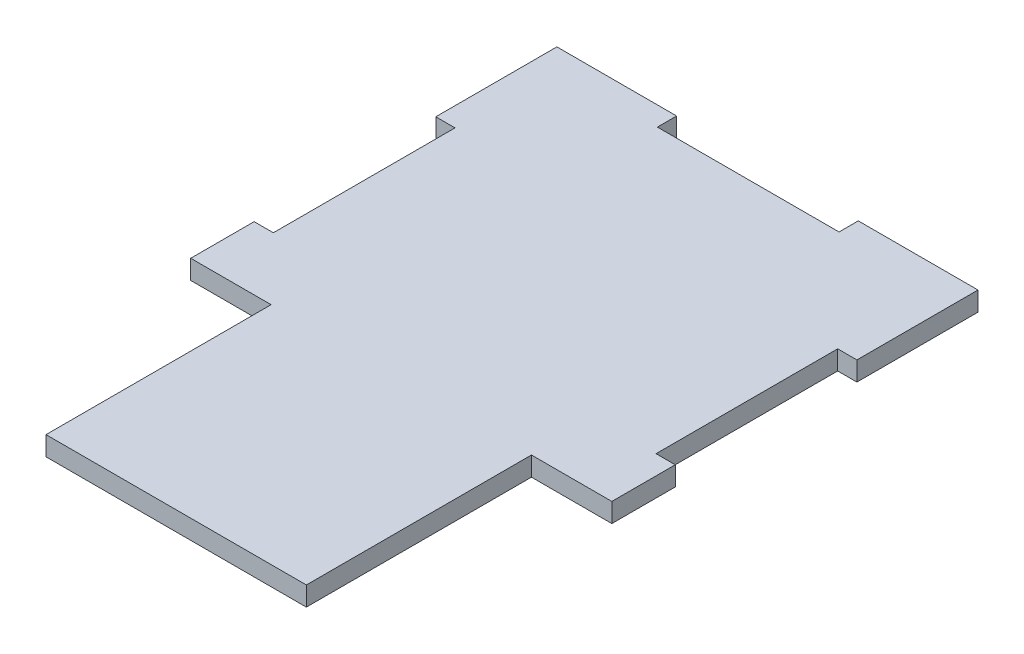
ISO-10303-21;
HEADER;
FILE_DESCRIPTION(('STEP AP214'),'2;1');
FILE_NAME('part.step','',(''),(''),'','','');
FILE_SCHEMA(('AUTOMOTIVE_DESIGN { 1 0 10303 214 1 1 1 1 }'));
ENDSEC;
DATA;
#1=APPLICATION_CONTEXT('core data for automotive mechanical design processes');
#2=APPLICATION_PROTOCOL_DEFINITION('international standard','automotive_design',2000,#1);
#3=PRODUCT_CONTEXT('',#1,'mechanical');
#4=PRODUCT('Part','Part','',(#3));
#5=PRODUCT_RELATED_PRODUCT_CATEGORY('part','',(#4));
#6=PRODUCT_DEFINITION_FORMATION('','',#4);
#7=PRODUCT_DEFINITION_CONTEXT('part definition',#1,'design');
#8=PRODUCT_DEFINITION('design','',#6,#7);
#9=PRODUCT_DEFINITION_SHAPE('','',#8);
#10=(LENGTH_UNIT() NAMED_UNIT(*) SI_UNIT(.MILLI.,.METRE.));
#11=(NAMED_UNIT(*) PLANE_ANGLE_UNIT() SI_UNIT($,.RADIAN.));
#12=(NAMED_UNIT(*) SI_UNIT($,.STERADIAN.) SOLID_ANGLE_UNIT());
#13=UNCERTAINTY_MEASURE_WITH_UNIT(LENGTH_MEASURE(1.E-05),#10,'distance_accuracy_value','');
#14=(GEOMETRIC_REPRESENTATION_CONTEXT(3) GLOBAL_UNCERTAINTY_ASSIGNED_CONTEXT((#13)) GLOBAL_UNIT_ASSIGNED_CONTEXT((#10,
#11,#12)) REPRESENTATION_CONTEXT('',''));
#15=CARTESIAN_POINT('',(0.,0.,0.));
#16=DIRECTION('',(0.,0.,1.));
#17=DIRECTION('',(1.,0.,0.));
#18=AXIS2_PLACEMENT_3D('',#15,#16,#17);
#19=CARTESIAN_POINT('',(66.375,3.175,0.));
#20=DIRECTION('',(-1.,0.,0.));
#21=DIRECTION('',(0.,0.,1.));
#22=AXIS2_PLACEMENT_3D('',#19,#20,#21);
#23=PLANE('',#22);
#24=DIRECTION('',(0.,0.,-1.));
#25=VECTOR('',#24,1.);
#26=CARTESIAN_POINT('',(66.375,0.,0.));
#27=LINE('',#26,#25);
#28=CARTESIAN_POINT('',(66.375,0.,-44.475));
#29=VERTEX_POINT('',#28);
#30=CARTESIAN_POINT('',(66.375,0.,-74.475));
#31=VERTEX_POINT('',#30);
#32=EDGE_CURVE('E218',#29,#31,#27,.T.);
#33=ORIENTED_EDGE('',*,*,#32,.T.);
#34=DIRECTION('',(0.,-1.,0.));
#35=VECTOR('',#34,1.);
#36=CARTESIAN_POINT('',(66.375,3.175,-74.475));
#37=LINE('',#36,#35);
#38=CARTESIAN_POINT('',(66.375,3.175,-74.475));
#39=VERTEX_POINT('',#38);
#40=EDGE_CURVE('E11',#39,#31,#37,.T.);
#41=ORIENTED_EDGE('',*,*,#40,.F.);
#42=DIRECTION('',(0.,0.,-1.));
#43=VECTOR('',#42,1.);
#44=CARTESIAN_POINT('',(66.375,3.175,0.));
#45=LINE('',#44,#43);
#46=CARTESIAN_POINT('',(66.375,3.175,-44.475));
#47=VERTEX_POINT('',#46);
#48=EDGE_CURVE('E283',#47,#39,#45,.T.);
#49=ORIENTED_EDGE('',*,*,#48,.F.);
#50=DIRECTION('',(0.,-1.,0.));
#51=VECTOR('',#50,1.);
#52=CARTESIAN_POINT('',(66.375,3.175,-44.475));
#53=LINE('',#52,#51);
#54=EDGE_CURVE('E58',#47,#29,#53,.T.);
#55=ORIENTED_EDGE('',*,*,#54,.T.);
#56=EDGE_LOOP('',(#33,#41,#49,#55));
#57=FACE_BOUND('',#56,.T.);
#58=ADVANCED_FACE('F41',(#57),#23,.F.);
#59=CARTESIAN_POINT('',(0.,3.175,-74.475));
#60=DIRECTION('',(0.,0.,-1.));
#61=DIRECTION('',(-1.,0.,0.));
#62=AXIS2_PLACEMENT_3D('',#59,#60,#61);
#63=PLANE('',#62);
#64=DIRECTION('',(1.,0.,0.));
#65=VECTOR('',#64,1.);
#66=CARTESIAN_POINT('',(0.,0.,-74.475));
#67=LINE('',#66,#65);
#68=CARTESIAN_POINT('',(69.55,0.,-74.475));
#69=VERTEX_POINT('',#68);
#70=EDGE_CURVE('E221',#31,#69,#67,.T.);
#71=ORIENTED_EDGE('',*,*,#70,.T.);
#72=DIRECTION('',(0.,-1.,0.));
#73=VECTOR('',#72,1.);
#74=CARTESIAN_POINT('',(69.55,3.175,-74.475));
#75=LINE('',#74,#73);
#76=CARTESIAN_POINT('',(69.55,3.175,-74.475));
#77=VERTEX_POINT('',#76);
#78=EDGE_CURVE('E50',#77,#69,#75,.T.);
#79=ORIENTED_EDGE('',*,*,#78,.F.);
#80=DIRECTION('',(1.,0.,0.));
#81=VECTOR('',#80,1.);
#82=CARTESIAN_POINT('',(0.,3.175,-74.475));
#83=LINE('',#82,#81);
#84=EDGE_CURVE('E133',#39,#77,#83,.T.);
#85=ORIENTED_EDGE('',*,*,#84,.F.);
#86=ORIENTED_EDGE('',*,*,#40,.T.);
#87=EDGE_LOOP('',(#71,#79,#85,#86));
#88=FACE_BOUND('',#87,.T.);
#89=ADVANCED_FACE('F430',(#88),#63,.F.);
#90=CARTESIAN_POINT('',(69.55,3.175,0.));
#91=DIRECTION('',(-1.,0.,0.));
#92=DIRECTION('',(0.,0.,1.));
#93=AXIS2_PLACEMENT_3D('',#90,#91,#92);
#94=PLANE('',#93);
#95=DIRECTION('',(0.,0.,-1.));
#96=VECTOR('',#95,1.);
#97=CARTESIAN_POINT('',(69.55,0.,0.));
#98=LINE('',#97,#96);
#99=CARTESIAN_POINT('',(69.55,0.,-94.475));
#100=VERTEX_POINT('',#99);
#101=EDGE_CURVE('E224',#69,#100,#98,.T.);
#102=ORIENTED_EDGE('',*,*,#101,.T.);
#103=DIRECTION('',(0.,-1.,0.));
#104=VECTOR('',#103,1.);
#105=CARTESIAN_POINT('',(69.55,3.175,-94.475));
#106=LINE('',#105,#104);
#107=CARTESIAN_POINT('',(69.55,3.175,-94.475));
#108=VERTEX_POINT('',#107);
#109=EDGE_CURVE('E331',#108,#100,#106,.T.);
#110=ORIENTED_EDGE('',*,*,#109,.F.);
#111=DIRECTION('',(0.,0.,-1.));
#112=VECTOR('',#111,1.);
#113=CARTESIAN_POINT('',(69.55,3.175,0.));
#114=LINE('',#113,#112);
#115=EDGE_CURVE('E204',#77,#108,#114,.T.);
#116=ORIENTED_EDGE('',*,*,#115,.F.);
#117=ORIENTED_EDGE('',*,*,#78,.T.);
#118=EDGE_LOOP('',(#102,#110,#116,#117));
#119=FACE_BOUND('',#118,.T.);
#120=ADVANCED_FACE('F338',(#119),#94,.F.);
#121=CARTESIAN_POINT('',(0.,3.175,-94.475));
#122=DIRECTION('',(0.,0.,-1.));
#123=DIRECTION('',(-1.,0.,0.));
#124=AXIS2_PLACEMENT_3D('',#121,#122,#123);
#125=PLANE('',#124);
#126=DIRECTION('',(1.,0.,0.));
#127=VECTOR('',#126,1.);
#128=CARTESIAN_POINT('',(0.,0.,-94.475));
#129=LINE('',#128,#127);
#130=CARTESIAN_POINT('',(49.775,0.,-94.475));
#131=VERTEX_POINT('',#130);
#132=EDGE_CURVE('E228',#131,#100,#129,.T.);
#133=ORIENTED_EDGE('',*,*,#132,.F.);
#134=DIRECTION('',(0.,-1.,0.));
#135=VECTOR('',#134,1.);
#136=CARTESIAN_POINT('',(49.775,3.175,-94.475));
#137=LINE('',#136,#135);
#138=CARTESIAN_POINT('',(49.775,3.175,-94.475));
#139=VERTEX_POINT('',#138);
#140=EDGE_CURVE('E328',#139,#131,#137,.T.);
#141=ORIENTED_EDGE('',*,*,#140,.F.);
#142=DIRECTION('',(1.,0.,0.));
#143=VECTOR('',#142,1.);
#144=CARTESIAN_POINT('',(0.,3.175,-94.475));
#145=LINE('',#144,#143);
#146=EDGE_CURVE('E348',#139,#108,#145,.T.);
#147=ORIENTED_EDGE('',*,*,#146,.T.);
#148=ORIENTED_EDGE('',*,*,#109,.T.);
#149=EDGE_LOOP('',(#133,#141,#147,#148));
#150=FACE_BOUND('',#149,.T.);
#151=ADVANCED_FACE('F345',(#150),#125,.T.);
#152=CARTESIAN_POINT('',(49.775,3.175,0.));
#153=DIRECTION('',(-1.,0.,0.));
#154=DIRECTION('',(0.,0.,1.));
#155=AXIS2_PLACEMENT_3D('',#152,#153,#154);
#156=PLANE('',#155);
#157=DIRECTION('',(0.,0.,-1.));
#158=VECTOR('',#157,1.);
#159=CARTESIAN_POINT('',(49.775,0.,0.));
#160=LINE('',#159,#158);
#161=CARTESIAN_POINT('',(49.775,0.,-91.3));
#162=VERTEX_POINT('',#161);
#163=EDGE_CURVE('E233',#162,#131,#160,.T.);
#164=ORIENTED_EDGE('',*,*,#163,.F.);
#165=DIRECTION('',(0.,-1.,0.));
#166=VECTOR('',#165,1.);
#167=CARTESIAN_POINT('',(49.775,3.175,-91.3));
#168=LINE('',#167,#166);
#169=CARTESIAN_POINT('',(49.775,3.175,-91.3));
#170=VERTEX_POINT('',#169);
#171=EDGE_CURVE('E325',#170,#162,#168,.T.);
#172=ORIENTED_EDGE('',*,*,#171,.F.);
#173=DIRECTION('',(0.,0.,-1.));
#174=VECTOR('',#173,1.);
#175=CARTESIAN_POINT('',(49.775,3.175,0.));
#176=LINE('',#175,#174);
#177=EDGE_CURVE('E352',#170,#139,#176,.T.);
#178=ORIENTED_EDGE('',*,*,#177,.T.);
#179=ORIENTED_EDGE('',*,*,#140,.T.);
#180=EDGE_LOOP('',(#164,#172,#178,#179));
#181=FACE_BOUND('',#180,.T.);
#182=ADVANCED_FACE('F420',(#181),#156,.T.);
#183=CARTESIAN_POINT('',(0.,3.175,-91.3));
#184=DIRECTION('',(0.,0.,-1.));
#185=DIRECTION('',(-1.,0.,0.));
#186=AXIS2_PLACEMENT_3D('',#183,#184,#185);
#187=PLANE('',#186);
#188=DIRECTION('',(1.,0.,0.));
#189=VECTOR('',#188,1.);
#190=CARTESIAN_POINT('',(0.,0.,-91.3));
#191=LINE('',#190,#189);
#192=CARTESIAN_POINT('',(19.775,0.,-91.3));
#193=VERTEX_POINT('',#192);
#194=EDGE_CURVE('E238',#193,#162,#191,.T.);
#195=ORIENTED_EDGE('',*,*,#194,.F.);
#196=DIRECTION('',(0.,-1.,0.));
#197=VECTOR('',#196,1.);
#198=CARTESIAN_POINT('',(19.775,3.175,-91.3));
#199=LINE('',#198,#197);
#200=CARTESIAN_POINT('',(19.775,3.175,-91.3));
#201=VERTEX_POINT('',#200);
#202=EDGE_CURVE('E322',#201,#193,#199,.T.);
#203=ORIENTED_EDGE('',*,*,#202,.F.);
#204=DIRECTION('',(1.,0.,0.));
#205=VECTOR('',#204,1.);
#206=CARTESIAN_POINT('',(0.,3.175,-91.3));
#207=LINE('',#206,#205);
#208=EDGE_CURVE('E357',#201,#170,#207,.T.);
#209=ORIENTED_EDGE('',*,*,#208,.T.);
#210=ORIENTED_EDGE('',*,*,#171,.T.);
#211=EDGE_LOOP('',(#195,#203,#209,#210));
#212=FACE_BOUND('',#211,.T.);
#213=ADVANCED_FACE('F418',(#212),#187,.T.);
#214=CARTESIAN_POINT('',(19.775,3.175,0.));
#215=DIRECTION('',(-1.,0.,0.));
#216=DIRECTION('',(0.,0.,1.));
#217=AXIS2_PLACEMENT_3D('',#214,#215,#216);
#218=PLANE('',#217);
#219=DIRECTION('',(0.,0.,-1.));
#220=VECTOR('',#219,1.);
#221=CARTESIAN_POINT('',(19.775,0.,0.));
#222=LINE('',#221,#220);
#223=CARTESIAN_POINT('',(19.775,0.,-94.475));
#224=VERTEX_POINT('',#223);
#225=EDGE_CURVE('E242',#193,#224,#222,.T.);
#226=ORIENTED_EDGE('',*,*,#225,.T.);
#227=DIRECTION('',(0.,-1.,0.));
#228=VECTOR('',#227,1.);
#229=CARTESIAN_POINT('',(19.775,3.175,-94.475));
#230=LINE('',#229,#228);
#231=CARTESIAN_POINT('',(19.775,3.175,-94.475));
#232=VERTEX_POINT('',#231);
#233=EDGE_CURVE('E319',#232,#224,#230,.T.);
#234=ORIENTED_EDGE('',*,*,#233,.F.);
#235=DIRECTION('',(0.,0.,-1.));
#236=VECTOR('',#235,1.);
#237=CARTESIAN_POINT('',(19.775,3.175,0.));
#238=LINE('',#237,#236);
#239=EDGE_CURVE('E362',#201,#232,#238,.T.);
#240=ORIENTED_EDGE('',*,*,#239,.F.);
#241=ORIENTED_EDGE('',*,*,#202,.T.);
#242=EDGE_LOOP('',(#226,#234,#240,#241));
#243=FACE_BOUND('',#242,.T.);
#244=ADVANCED_FACE('F416',(#243),#218,.F.);
#245=CARTESIAN_POINT('',(0.,0.,-94.475));
#246=VERTEX_POINT('',#245);
#247=EDGE_CURVE('E234',#246,#224,#129,.T.);
#248=ORIENTED_EDGE('',*,*,#247,.F.);
#249=DIRECTION('',(0.,-1.,0.));
#250=VECTOR('',#249,1.);
#251=CARTESIAN_POINT('',(0.,3.175,-94.475));
#252=LINE('',#251,#250);
#253=CARTESIAN_POINT('',(0.,3.175,-94.475));
#254=VERTEX_POINT('',#253);
#255=EDGE_CURVE('E316',#254,#246,#252,.T.);
#256=ORIENTED_EDGE('',*,*,#255,.F.);
#257=EDGE_CURVE('E354',#254,#232,#145,.T.);
#258=ORIENTED_EDGE('',*,*,#257,.T.);
#259=ORIENTED_EDGE('',*,*,#233,.T.);
#260=EDGE_LOOP('',(#248,#256,#258,#259));
#261=FACE_BOUND('',#260,.T.);
#262=ADVANCED_FACE('F414',(#261),#125,.T.);
#263=CARTESIAN_POINT('',(0.,3.175,0.));
#264=DIRECTION('',(-1.,0.,0.));
#265=DIRECTION('',(0.,0.,1.));
#266=AXIS2_PLACEMENT_3D('',#263,#264,#265);
#267=PLANE('',#266);
#268=DIRECTION('',(0.,0.,-1.));
#269=VECTOR('',#268,1.);
#270=CARTESIAN_POINT('',(0.,0.,0.));
#271=LINE('',#270,#269);
#272=CARTESIAN_POINT('',(0.,0.,-74.475));
#273=VERTEX_POINT('',#272);
#274=EDGE_CURVE('E246',#273,#246,#271,.T.);
#275=ORIENTED_EDGE('',*,*,#274,.F.);
#276=DIRECTION('',(0.,-1.,0.));
#277=VECTOR('',#276,1.);
#278=CARTESIAN_POINT('',(0.,3.175,-74.475));
#279=LINE('',#278,#277);
#280=CARTESIAN_POINT('',(0.,3.175,-74.475));
#281=VERTEX_POINT('',#280);
#282=EDGE_CURVE('E313',#281,#273,#279,.T.);
#283=ORIENTED_EDGE('',*,*,#282,.F.);
#284=DIRECTION('',(0.,0.,-1.));
#285=VECTOR('',#284,1.);
#286=CARTESIAN_POINT('',(0.,3.175,0.));
#287=LINE('',#286,#285);
#288=EDGE_CURVE('E361',#281,#254,#287,.T.);
#289=ORIENTED_EDGE('',*,*,#288,.T.);
#290=ORIENTED_EDGE('',*,*,#255,.T.);
#291=EDGE_LOOP('',(#275,#283,#289,#290));
#292=FACE_BOUND('',#291,.T.);
#293=ADVANCED_FACE('F465',(#292),#267,.T.);
#294=CARTESIAN_POINT('',(0.,3.175,-74.475));
#295=DIRECTION('',(0.,0.,1.));
#296=DIRECTION('',(1.,0.,0.));
#297=AXIS2_PLACEMENT_3D('',#294,#295,#296);
#298=PLANE('',#297);
#299=DIRECTION('',(-1.,0.,0.));
#300=VECTOR('',#299,1.);
#301=CARTESIAN_POINT('',(0.,0.,-74.475));
#302=LINE('',#301,#300);
#303=CARTESIAN_POINT('',(3.175,0.,-74.475));
#304=VERTEX_POINT('',#303);
#305=EDGE_CURVE('E250',#304,#273,#302,.T.);
#306=ORIENTED_EDGE('',*,*,#305,.F.);
#307=DIRECTION('',(0.,-1.,0.));
#308=VECTOR('',#307,1.);
#309=CARTESIAN_POINT('',(3.175,3.175,-74.475));
#310=LINE('',#309,#308);
#311=CARTESIAN_POINT('',(3.175,3.175,-74.475));
#312=VERTEX_POINT('',#311);
#313=EDGE_CURVE('E310',#312,#304,#310,.T.);
#314=ORIENTED_EDGE('',*,*,#313,.F.);
#315=DIRECTION('',(-1.,0.,0.));
#316=VECTOR('',#315,1.);
#317=CARTESIAN_POINT('',(0.,3.175,-74.475));
#318=LINE('',#317,#316);
#319=EDGE_CURVE('E368',#312,#281,#318,.T.);
#320=ORIENTED_EDGE('',*,*,#319,.T.);
#321=ORIENTED_EDGE('',*,*,#282,.T.);
#322=EDGE_LOOP('',(#306,#314,#320,#321));
#323=FACE_BOUND('',#322,.T.);
#324=ADVANCED_FACE('F472',(#323),#298,.T.);
#325=CARTESIAN_POINT('',(3.17500000000001,3.175,0.));
#326=DIRECTION('',(1.,0.,0.));
#327=DIRECTION('',(0.,0.,-1.));
#328=AXIS2_PLACEMENT_3D('',#325,#326,#327);
#329=PLANE('',#328);
#330=DIRECTION('',(0.,0.,1.));
#331=VECTOR('',#330,1.);
#332=CARTESIAN_POINT('',(3.17500000000001,0.,0.));
#333=LINE('',#332,#331);
#334=CARTESIAN_POINT('',(3.175,0.,-44.475));
#335=VERTEX_POINT('',#334);
#336=EDGE_CURVE('E255',#304,#335,#333,.T.);
#337=ORIENTED_EDGE('',*,*,#336,.T.);
#338=DIRECTION('',(0.,-1.,0.));
#339=VECTOR('',#338,1.);
#340=CARTESIAN_POINT('',(3.175,3.175,-44.475));
#341=LINE('',#340,#339);
#342=CARTESIAN_POINT('',(3.175,3.175,-44.475));
#343=VERTEX_POINT('',#342);
#344=EDGE_CURVE('E306',#343,#335,#341,.T.);
#345=ORIENTED_EDGE('',*,*,#344,.F.);
#346=DIRECTION('',(0.,0.,1.));
#347=VECTOR('',#346,1.);
#348=CARTESIAN_POINT('',(3.17500000000001,3.175,0.));
#349=LINE('',#348,#347);
#350=EDGE_CURVE('E382',#312,#343,#349,.T.);
#351=ORIENTED_EDGE('',*,*,#350,.F.);
#352=ORIENTED_EDGE('',*,*,#313,.T.);
#353=EDGE_LOOP('',(#337,#345,#351,#352));
#354=FACE_BOUND('',#353,.T.);
#355=ADVANCED_FACE('F468',(#354),#329,.F.);
#356=CARTESIAN_POINT('',(0.,3.175,-44.475));
#357=DIRECTION('',(0.,0.,1.));
#358=DIRECTION('',(1.,0.,0.));
#359=AXIS2_PLACEMENT_3D('',#356,#357,#358);
#360=PLANE('',#359);
#361=DIRECTION('',(-1.,0.,0.));
#362=VECTOR('',#361,1.);
#363=CARTESIAN_POINT('',(0.,0.,-44.475));
#364=LINE('',#363,#362);
#365=CARTESIAN_POINT('',(0.,0.,-44.475));
#366=VERTEX_POINT('',#365);
#367=EDGE_CURVE('E258',#335,#366,#364,.T.);
#368=ORIENTED_EDGE('',*,*,#367,.T.);
#369=DIRECTION('',(0.,-1.,0.));
#370=VECTOR('',#369,1.);
#371=CARTESIAN_POINT('',(0.,3.175,-44.475));
#372=LINE('',#371,#370);
#373=CARTESIAN_POINT('',(0.,3.175,-44.475));
#374=VERTEX_POINT('',#373);
#375=EDGE_CURVE('E303',#374,#366,#372,.T.);
#376=ORIENTED_EDGE('',*,*,#375,.F.);
#377=DIRECTION('',(-1.,0.,0.));
#378=VECTOR('',#377,1.);
#379=CARTESIAN_POINT('',(0.,3.175,-44.475));
#380=LINE('',#379,#378);
#381=EDGE_CURVE('E385',#343,#374,#380,.T.);
#382=ORIENTED_EDGE('',*,*,#381,.F.);
#383=ORIENTED_EDGE('',*,*,#344,.T.);
#384=EDGE_LOOP('',(#368,#376,#382,#383));
#385=FACE_BOUND('',#384,.T.);
#386=ADVANCED_FACE('F463',(#385),#360,.F.);
#387=CARTESIAN_POINT('',(0.,0.,-34.));
#388=VERTEX_POINT('',#387);
#389=EDGE_CURVE('E251',#388,#366,#271,.T.);
#390=ORIENTED_EDGE('',*,*,#389,.F.);
#391=DIRECTION('',(0.,-1.,0.));
#392=VECTOR('',#391,1.);
#393=CARTESIAN_POINT('',(0.,3.175,-34.));
#394=LINE('',#393,#392);
#395=CARTESIAN_POINT('',(0.,3.175,-34.));
#396=VERTEX_POINT('',#395);
#397=EDGE_CURVE('E300',#396,#388,#394,.T.);
#398=ORIENTED_EDGE('',*,*,#397,.F.);
#399=EDGE_CURVE('E370',#396,#374,#287,.T.);
#400=ORIENTED_EDGE('',*,*,#399,.T.);
#401=ORIENTED_EDGE('',*,*,#375,.T.);
#402=EDGE_LOOP('',(#390,#398,#400,#401));
#403=FACE_BOUND('',#402,.T.);
#404=ADVANCED_FACE('F459',(#403),#267,.T.);
#405=CARTESIAN_POINT('',(0.,3.175,-34.));
#406=DIRECTION('',(0.,0.,-1.));
#407=DIRECTION('',(-1.,0.,0.));
#408=AXIS2_PLACEMENT_3D('',#405,#406,#407);
#409=PLANE('',#408);
#410=DIRECTION('',(1.,0.,0.));
#411=VECTOR('',#410,1.);
#412=CARTESIAN_POINT('',(0.,0.,-34.));
#413=LINE('',#412,#411);
#414=CARTESIAN_POINT('',(13.275,0.,-34.));
#415=VERTEX_POINT('',#414);
#416=EDGE_CURVE('E262',#388,#415,#413,.T.);
#417=ORIENTED_EDGE('',*,*,#416,.T.);
#418=DIRECTION('',(0.,-1.,0.));
#419=VECTOR('',#418,1.);
#420=CARTESIAN_POINT('',(13.275,3.175,-34.));
#421=LINE('',#420,#419);
#422=CARTESIAN_POINT('',(13.275,3.175,-34.));
#423=VERTEX_POINT('',#422);
#424=EDGE_CURVE('E297',#423,#415,#421,.T.);
#425=ORIENTED_EDGE('',*,*,#424,.F.);
#426=DIRECTION('',(1.,0.,0.));
#427=VECTOR('',#426,1.);
#428=CARTESIAN_POINT('',(0.,3.175,-34.));
#429=LINE('',#428,#427);
#430=EDGE_CURVE('E388',#396,#423,#429,.T.);
#431=ORIENTED_EDGE('',*,*,#430,.F.);
#432=ORIENTED_EDGE('',*,*,#397,.T.);
#433=EDGE_LOOP('',(#417,#425,#431,#432));
#434=FACE_BOUND('',#433,.T.);
#435=ADVANCED_FACE('F455',(#434),#409,.F.);
#436=CARTESIAN_POINT('',(13.275,3.175,0.));
#437=DIRECTION('',(-1.,0.,0.));
#438=DIRECTION('',(0.,0.,1.));
#439=AXIS2_PLACEMENT_3D('',#436,#437,#438);
#440=PLANE('',#439);
#441=DIRECTION('',(0.,0.,-1.));
#442=VECTOR('',#441,1.);
#443=CARTESIAN_POINT('',(13.275,0.,0.));
#444=LINE('',#443,#442);
#445=CARTESIAN_POINT('',(13.275,0.,3.175));
#446=VERTEX_POINT('',#445);
#447=EDGE_CURVE('E266',#446,#415,#444,.T.);
#448=ORIENTED_EDGE('',*,*,#447,.F.);
#449=DIRECTION('',(0.,-1.,0.));
#450=VECTOR('',#449,1.);
#451=CARTESIAN_POINT('',(13.275,3.175,3.175));
#452=LINE('',#451,#450);
#453=CARTESIAN_POINT('',(13.275,3.175,3.175));
#454=VERTEX_POINT('',#453);
#455=EDGE_CURVE('E294',#454,#446,#452,.T.);
#456=ORIENTED_EDGE('',*,*,#455,.F.);
#457=DIRECTION('',(0.,0.,-1.));
#458=VECTOR('',#457,1.);
#459=CARTESIAN_POINT('',(13.275,3.175,0.));
#460=LINE('',#459,#458);
#461=EDGE_CURVE('E391',#454,#423,#460,.T.);
#462=ORIENTED_EDGE('',*,*,#461,.T.);
#463=ORIENTED_EDGE('',*,*,#424,.T.);
#464=EDGE_LOOP('',(#448,#456,#462,#463));
#465=FACE_BOUND('',#464,.T.);
#466=ADVANCED_FACE('F452',(#465),#440,.T.);
#467=CARTESIAN_POINT('',(0.,3.175,3.175));
#468=DIRECTION('',(0.,0.,-1.));
#469=DIRECTION('',(-1.,0.,0.));
#470=AXIS2_PLACEMENT_3D('',#467,#468,#469);
#471=PLANE('',#470);
#472=DIRECTION('',(1.,0.,0.));
#473=VECTOR('',#472,1.);
#474=CARTESIAN_POINT('',(0.,0.,3.175));
#475=LINE('',#474,#473);
#476=CARTESIAN_POINT('',(56.275,0.,3.175));
#477=VERTEX_POINT('',#476);
#478=EDGE_CURVE('E270',#446,#477,#475,.T.);
#479=ORIENTED_EDGE('',*,*,#478,.T.);
#480=DIRECTION('',(0.,-1.,0.));
#481=VECTOR('',#480,1.);
#482=CARTESIAN_POINT('',(56.275,3.175,3.175));
#483=LINE('',#482,#481);
#484=CARTESIAN_POINT('',(56.275,3.175,3.175));
#485=VERTEX_POINT('',#484);
#486=EDGE_CURVE('E290',#485,#477,#483,.T.);
#487=ORIENTED_EDGE('',*,*,#486,.F.);
#488=DIRECTION('',(1.,0.,0.));
#489=VECTOR('',#488,1.);
#490=CARTESIAN_POINT('',(0.,3.175,3.175));
#491=LINE('',#490,#489);
#492=EDGE_CURVE('E212',#454,#485,#491,.T.);
#493=ORIENTED_EDGE('',*,*,#492,.F.);
#494=ORIENTED_EDGE('',*,*,#455,.T.);
#495=EDGE_LOOP('',(#479,#487,#493,#494));
#496=FACE_BOUND('',#495,.T.);
#497=ADVANCED_FACE('F399',(#496),#471,.F.);
#498=CARTESIAN_POINT('',(56.275,3.175,0.));
#499=DIRECTION('',(-1.,0.,0.));
#500=DIRECTION('',(0.,0.,1.));
#501=AXIS2_PLACEMENT_3D('',#498,#499,#500);
#502=PLANE('',#501);
#503=DIRECTION('',(0.,0.,-1.));
#504=VECTOR('',#503,1.);
#505=CARTESIAN_POINT('',(56.275,0.,0.));
#506=LINE('',#505,#504);
#507=CARTESIAN_POINT('',(56.275,0.,-34.));
#508=VERTEX_POINT('',#507);
#509=EDGE_CURVE('E273',#477,#508,#506,.T.);
#510=ORIENTED_EDGE('',*,*,#509,.T.);
#511=DIRECTION('',(0.,-1.,0.));
#512=VECTOR('',#511,1.);
#513=CARTESIAN_POINT('',(56.275,3.175,-34.));
#514=LINE('',#513,#512);
#515=CARTESIAN_POINT('',(56.275,3.175,-34.));
#516=VERTEX_POINT('',#515);
#517=EDGE_CURVE('E195',#516,#508,#514,.T.);
#518=ORIENTED_EDGE('',*,*,#517,.F.);
#519=DIRECTION('',(0.,0.,-1.));
#520=VECTOR('',#519,1.);
#521=CARTESIAN_POINT('',(56.275,3.175,0.));
#522=LINE('',#521,#520);
#523=EDGE_CURVE('E207',#485,#516,#522,.T.);
#524=ORIENTED_EDGE('',*,*,#523,.F.);
#525=ORIENTED_EDGE('',*,*,#486,.T.);
#526=EDGE_LOOP('',(#510,#518,#524,#525));
#527=FACE_BOUND('',#526,.T.);
#528=ADVANCED_FACE('F403',(#527),#502,.F.);
#529=CARTESIAN_POINT('',(0.,3.175,-34.));
#530=DIRECTION('',(0.,0.,1.));
#531=DIRECTION('',(1.,0.,0.));
#532=AXIS2_PLACEMENT_3D('',#529,#530,#531);
#533=PLANE('',#532);
#534=DIRECTION('',(-1.,0.,0.));
#535=VECTOR('',#534,1.);
#536=CARTESIAN_POINT('',(0.,0.,-34.));
#537=LINE('',#536,#535);
#538=CARTESIAN_POINT('',(69.55,0.,-34.));
#539=VERTEX_POINT('',#538);
#540=EDGE_CURVE('E191',#539,#508,#537,.T.);
#541=ORIENTED_EDGE('',*,*,#540,.F.);
#542=DIRECTION('',(0.,-1.,0.));
#543=VECTOR('',#542,1.);
#544=CARTESIAN_POINT('',(69.55,3.175,-34.));
#545=LINE('',#544,#543);
#546=CARTESIAN_POINT('',(69.55,3.175,-34.));
#547=VERTEX_POINT('',#546);
#548=EDGE_CURVE('E185',#547,#539,#545,.T.);
#549=ORIENTED_EDGE('',*,*,#548,.F.);
#550=DIRECTION('',(-1.,0.,0.));
#551=VECTOR('',#550,1.);
#552=CARTESIAN_POINT('',(0.,3.175,-34.));
#553=LINE('',#552,#551);
#554=EDGE_CURVE('E189',#547,#516,#553,.T.);
#555=ORIENTED_EDGE('',*,*,#554,.T.);
#556=ORIENTED_EDGE('',*,*,#517,.T.);
#557=EDGE_LOOP('',(#541,#549,#555,#556));
#558=FACE_BOUND('',#557,.T.);
#559=ADVANCED_FACE('F187',(#558),#533,.T.);
#560=CARTESIAN_POINT('',(69.55,0.,-44.475));
#561=VERTEX_POINT('',#560);
#562=EDGE_CURVE('E229',#539,#561,#98,.T.);
#563=ORIENTED_EDGE('',*,*,#562,.T.);
#564=DIRECTION('',(0.,-1.,0.));
#565=VECTOR('',#564,1.);
#566=CARTESIAN_POINT('',(69.55,3.175,-44.475));
#567=LINE('',#566,#565);
#568=CARTESIAN_POINT('',(69.55,3.175,-44.475));
#569=VERTEX_POINT('',#568);
#570=EDGE_CURVE('E121',#569,#561,#567,.T.);
#571=ORIENTED_EDGE('',*,*,#570,.F.);
#572=EDGE_CURVE('E197',#547,#569,#114,.T.);
#573=ORIENTED_EDGE('',*,*,#572,.F.);
#574=ORIENTED_EDGE('',*,*,#548,.T.);
#575=EDGE_LOOP('',(#563,#571,#573,#574));
#576=FACE_BOUND('',#575,.T.);
#577=ADVANCED_FACE('F198',(#576),#94,.F.);
#578=CARTESIAN_POINT('',(0.,3.175,-44.475));
#579=DIRECTION('',(0.,0.,-1.));
#580=DIRECTION('',(-1.,0.,0.));
#581=AXIS2_PLACEMENT_3D('',#578,#579,#580);
#582=PLANE('',#581);
#583=DIRECTION('',(1.,0.,0.));
#584=VECTOR('',#583,1.);
#585=CARTESIAN_POINT('',(0.,0.,-44.475));
#586=LINE('',#585,#584);
#587=EDGE_CURVE('E279',#29,#561,#586,.T.);
#588=ORIENTED_EDGE('',*,*,#587,.F.);
#589=ORIENTED_EDGE('',*,*,#54,.F.);
#590=DIRECTION('',(1.,0.,0.));
#591=VECTOR('',#590,1.);
#592=CARTESIAN_POINT('',(0.,3.175,-44.475));
#593=LINE('',#592,#591);
#594=EDGE_CURVE('E202',#47,#569,#593,.T.);
#595=ORIENTED_EDGE('',*,*,#594,.T.);
#596=ORIENTED_EDGE('',*,*,#570,.T.);
#597=EDGE_LOOP('',(#588,#589,#595,#596));
#598=FACE_BOUND('',#597,.T.);
#599=ADVANCED_FACE('F435',(#598),#582,.T.);
#600=CARTESIAN_POINT('',(0.,3.175,0.));
#601=DIRECTION('',(0.,1.,0.));
#602=DIRECTION('',(0.,0.,1.));
#603=AXIS2_PLACEMENT_3D('',#600,#601,#602);
#604=PLANE('',#603);
#605=ORIENTED_EDGE('',*,*,#48,.T.);
#606=ORIENTED_EDGE('',*,*,#84,.T.);
#607=ORIENTED_EDGE('',*,*,#115,.T.);
#608=ORIENTED_EDGE('',*,*,#146,.F.);
#609=ORIENTED_EDGE('',*,*,#177,.F.);
#610=ORIENTED_EDGE('',*,*,#208,.F.);
#611=ORIENTED_EDGE('',*,*,#239,.T.);
#612=ORIENTED_EDGE('',*,*,#257,.F.);
#613=ORIENTED_EDGE('',*,*,#288,.F.);
#614=ORIENTED_EDGE('',*,*,#319,.F.);
#615=ORIENTED_EDGE('',*,*,#350,.T.);
#616=ORIENTED_EDGE('',*,*,#381,.T.);
#617=ORIENTED_EDGE('',*,*,#399,.F.);
#618=ORIENTED_EDGE('',*,*,#430,.T.);
#619=ORIENTED_EDGE('',*,*,#461,.F.);
#620=ORIENTED_EDGE('',*,*,#492,.T.);
#621=ORIENTED_EDGE('',*,*,#523,.T.);
#622=ORIENTED_EDGE('',*,*,#554,.F.);
#623=ORIENTED_EDGE('',*,*,#572,.T.);
#624=ORIENTED_EDGE('',*,*,#594,.F.);
#625=EDGE_LOOP('',(#605,#606,#607,#608,#609,#610,#611,#612,#613,#614,#615,#616,#617,#618,#619,
#620,#621,#622,#623,#624));
#626=FACE_BOUND('',#625,.T.);
#627=ADVANCED_FACE('F205',(#626),#604,.T.);
#628=CARTESIAN_POINT('',(0.,0.,0.));
#629=DIRECTION('',(0.,1.,0.));
#630=DIRECTION('',(0.,0.,1.));
#631=AXIS2_PLACEMENT_3D('',#628,#629,#630);
#632=PLANE('',#631);
#633=ORIENTED_EDGE('',*,*,#32,.F.);
#634=ORIENTED_EDGE('',*,*,#587,.T.);
#635=ORIENTED_EDGE('',*,*,#562,.F.);
#636=ORIENTED_EDGE('',*,*,#540,.T.);
#637=ORIENTED_EDGE('',*,*,#509,.F.);
#638=ORIENTED_EDGE('',*,*,#478,.F.);
#639=ORIENTED_EDGE('',*,*,#447,.T.);
#640=ORIENTED_EDGE('',*,*,#416,.F.);
#641=ORIENTED_EDGE('',*,*,#389,.T.);
#642=ORIENTED_EDGE('',*,*,#367,.F.);
#643=ORIENTED_EDGE('',*,*,#336,.F.);
#644=ORIENTED_EDGE('',*,*,#305,.T.);
#645=ORIENTED_EDGE('',*,*,#274,.T.);
#646=ORIENTED_EDGE('',*,*,#247,.T.);
#647=ORIENTED_EDGE('',*,*,#225,.F.);
#648=ORIENTED_EDGE('',*,*,#194,.T.);
#649=ORIENTED_EDGE('',*,*,#163,.T.);
#650=ORIENTED_EDGE('',*,*,#132,.T.);
#651=ORIENTED_EDGE('',*,*,#101,.F.);
#652=ORIENTED_EDGE('',*,*,#70,.F.);
#653=EDGE_LOOP('',(#633,#634,#635,#636,#637,#638,#639,#640,#641,#642,#643,#644,#645,#646,#647,
#648,#649,#650,#651,#652));
#654=FACE_BOUND('',#653,.T.);
#655=ADVANCED_FACE('F341',(#654),#632,.F.);
#656=CLOSED_SHELL('',(#58,#89,#120,#151,#182,#213,#244,#262,#293,#324,#355,#386,#404,#435,#466,
#497,#528,#559,#577,#599,#627,#655));
#657=MANIFOLD_SOLID_BREP('B2',#656);
#658=ADVANCED_BREP_SHAPE_REPRESENTATION('',(#18,#657),#14);
#659=SHAPE_DEFINITION_REPRESENTATION(#9,#658);
ENDSEC;
END-ISO-10303-21;
